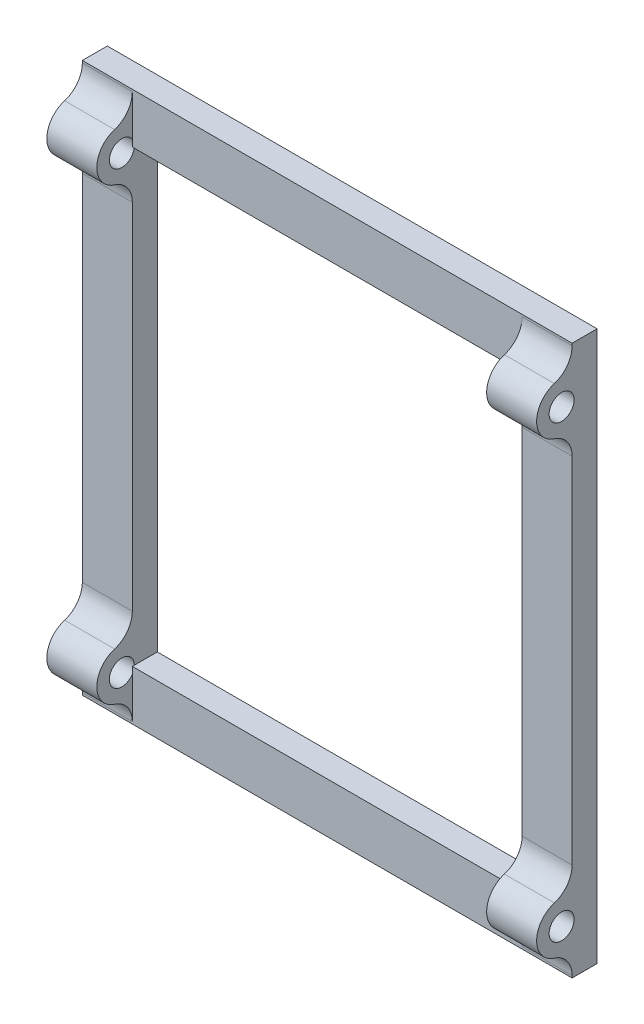
ISO-10303-21;
HEADER;
FILE_DESCRIPTION(('STEP AP214'),'2;1');
FILE_NAME('part.step','',(''),(''),'','','');
FILE_SCHEMA(('AUTOMOTIVE_DESIGN { 1 0 10303 214 1 1 1 1 }'));
ENDSEC;
DATA;
#1=APPLICATION_CONTEXT('core data for automotive mechanical design processes');
#2=APPLICATION_PROTOCOL_DEFINITION('international standard','automotive_design',2000,#1);
#3=PRODUCT_CONTEXT('',#1,'mechanical');
#4=PRODUCT('Part','Part','',(#3));
#5=PRODUCT_RELATED_PRODUCT_CATEGORY('part','',(#4));
#6=PRODUCT_DEFINITION_FORMATION('','',#4);
#7=PRODUCT_DEFINITION_CONTEXT('part definition',#1,'design');
#8=PRODUCT_DEFINITION('design','',#6,#7);
#9=PRODUCT_DEFINITION_SHAPE('','',#8);
#10=(LENGTH_UNIT() NAMED_UNIT(*) SI_UNIT(.MILLI.,.METRE.));
#11=(NAMED_UNIT(*) PLANE_ANGLE_UNIT() SI_UNIT($,.RADIAN.));
#12=(NAMED_UNIT(*) SI_UNIT($,.STERADIAN.) SOLID_ANGLE_UNIT());
#13=UNCERTAINTY_MEASURE_WITH_UNIT(LENGTH_MEASURE(1.E-05),#10,'distance_accuracy_value','');
#14=(GEOMETRIC_REPRESENTATION_CONTEXT(3) GLOBAL_UNCERTAINTY_ASSIGNED_CONTEXT((#13)) GLOBAL_UNIT_ASSIGNED_CONTEXT((#10,
#11,#12)) REPRESENTATION_CONTEXT('',''));
#15=CARTESIAN_POINT('',(0.,0.,0.));
#16=DIRECTION('',(0.,0.,1.));
#17=DIRECTION('',(1.,0.,0.));
#18=AXIS2_PLACEMENT_3D('',#15,#16,#17);
#19=CARTESIAN_POINT('',(0.,0.,5.));
#20=DIRECTION('',(0.,0.,1.));
#21=DIRECTION('',(1.,0.,0.));
#22=AXIS2_PLACEMENT_3D('',#19,#20,#21);
#23=PLANE('',#22);
#24=DIRECTION('',(0.,1.,0.));
#25=VECTOR('',#24,1.);
#26=CARTESIAN_POINT('',(103.666666666667,104.166666666667,5.));
#27=LINE('',#26,#25);
#28=CARTESIAN_POINT('',(103.666666666667,-5.83333333333334,5.));
#29=VERTEX_POINT('',#28);
#30=CARTESIAN_POINT('',(103.666666666667,-5.4035997873042,5.));
#31=VERTEX_POINT('',#30);
#32=EDGE_CURVE('E352',#29,#31,#27,.T.);
#33=ORIENTED_EDGE('',*,*,#32,.T.);
#34=DIRECTION('',(-1.,0.,0.));
#35=VECTOR('',#34,1.);
#36=CARTESIAN_POINT('',(93.6666666666667,-5.40359978730421,5.));
#37=LINE('',#36,#35);
#38=CARTESIAN_POINT('',(93.6666666666667,-5.40359978730421,5.));
#39=VERTEX_POINT('',#38);
#40=EDGE_CURVE('E410',#31,#39,#37,.T.);
#41=ORIENTED_EDGE('',*,*,#40,.T.);
#42=DIRECTION('',(0.,1.,0.));
#43=VECTOR('',#42,1.);
#44=CARTESIAN_POINT('',(93.6666666666667,0.,5.));
#45=LINE('',#44,#43);
#46=CARTESIAN_POINT('',(93.6666666666667,2.8102006700416,5.));
#47=VERTEX_POINT('',#46);
#48=EDGE_CURVE('E285',#39,#47,#45,.T.);
#49=ORIENTED_EDGE('',*,*,#48,.T.);
#50=DIRECTION('',(0.,1.,0.));
#51=VECTOR('',#50,1.);
#52=CARTESIAN_POINT('',(93.6666666666667,0.,5.));
#53=LINE('',#52,#51);
#54=CARTESIAN_POINT('',(93.6666666666667,4.16666666666666,5.));
#55=VERTEX_POINT('',#54);
#56=EDGE_CURVE('E248',#47,#55,#53,.T.);
#57=ORIENTED_EDGE('',*,*,#56,.T.);
#58=DIRECTION('',(1.,0.,0.));
#59=VECTOR('',#58,1.);
#60=CARTESIAN_POINT('',(15.6666666666667,4.16666666666666,5.));
#61=LINE('',#60,#59);
#62=CARTESIAN_POINT('',(15.6666666666667,4.16666666666666,5.));
#63=VERTEX_POINT('',#62);
#64=EDGE_CURVE('E239',#63,#55,#61,.T.);
#65=ORIENTED_EDGE('',*,*,#64,.F.);
#66=DIRECTION('',(0.,1.,0.));
#67=VECTOR('',#66,1.);
#68=CARTESIAN_POINT('',(15.6666666666667,0.,5.));
#69=LINE('',#68,#67);
#70=CARTESIAN_POINT('',(15.6666666666667,2.8102006700416,5.));
#71=VERTEX_POINT('',#70);
#72=EDGE_CURVE('E223',#71,#63,#69,.T.);
#73=ORIENTED_EDGE('',*,*,#72,.F.);
#74=DIRECTION('',(0.,1.,0.));
#75=VECTOR('',#74,1.);
#76=CARTESIAN_POINT('',(15.6666666666667,0.,5.));
#77=LINE('',#76,#75);
#78=CARTESIAN_POINT('',(15.6666666666667,-5.40359978730421,5.));
#79=VERTEX_POINT('',#78);
#80=EDGE_CURVE('E235',#79,#71,#77,.T.);
#81=ORIENTED_EDGE('',*,*,#80,.F.);
#82=DIRECTION('',(-1.,0.,0.));
#83=VECTOR('',#82,1.);
#84=CARTESIAN_POINT('',(5.66666666666668,-5.40359978730421,5.));
#85=LINE('',#84,#83);
#86=CARTESIAN_POINT('',(5.66666666666666,-5.4035997873042,5.));
#87=VERTEX_POINT('',#86);
#88=EDGE_CURVE('E408',#79,#87,#85,.T.);
#89=ORIENTED_EDGE('',*,*,#88,.T.);
#90=DIRECTION('',(0.,-1.,0.));
#91=VECTOR('',#90,1.);
#92=CARTESIAN_POINT('',(5.66666666666665,104.166666666667,5.));
#93=LINE('',#92,#91);
#94=CARTESIAN_POINT('',(5.66666666666666,-5.83333333333334,5.));
#95=VERTEX_POINT('',#94);
#96=EDGE_CURVE('E349',#87,#95,#93,.T.);
#97=ORIENTED_EDGE('',*,*,#96,.T.);
#98=DIRECTION('',(1.,0.,0.));
#99=VECTOR('',#98,1.);
#100=CARTESIAN_POINT('',(5.66666666666666,-5.83333333333334,5.));
#101=LINE('',#100,#99);
#102=EDGE_CURVE('E347',#95,#29,#101,.T.);
#103=ORIENTED_EDGE('',*,*,#102,.T.);
#104=EDGE_LOOP('',(#33,#41,#49,#57,#65,#73,#81,#89,#97,#103));
#105=FACE_BOUND('',#104,.T.);
#106=ADVANCED_FACE('F34',(#105),#23,.T.);
#107=CARTESIAN_POINT('',(5.66666666666665,104.166666666667,5.));
#108=VERTEX_POINT('',#107);
#109=CARTESIAN_POINT('',(5.66666666666665,103.736933120638,5.));
#110=VERTEX_POINT('',#109);
#111=EDGE_CURVE('E344',#108,#110,#93,.T.);
#112=ORIENTED_EDGE('',*,*,#111,.T.);
#113=DIRECTION('',(-1.,0.,0.));
#114=VECTOR('',#113,1.);
#115=CARTESIAN_POINT('',(15.6666666666667,103.736933120638,5.));
#116=LINE('',#115,#114);
#117=CARTESIAN_POINT('',(15.6666666666667,103.736933120638,5.));
#118=VERTEX_POINT('',#117);
#119=EDGE_CURVE('E385',#110,#118,#116,.F.);
#120=ORIENTED_EDGE('',*,*,#119,.T.);
#121=DIRECTION('',(0.,1.,0.));
#122=VECTOR('',#121,1.);
#123=CARTESIAN_POINT('',(15.6666666666667,0.,5.));
#124=LINE('',#123,#122);
#125=CARTESIAN_POINT('',(15.6666666666667,95.5231326632917,5.));
#126=VERTEX_POINT('',#125);
#127=EDGE_CURVE('E271',#126,#118,#124,.T.);
#128=ORIENTED_EDGE('',*,*,#127,.F.);
#129=DIRECTION('',(0.,1.,0.));
#130=VECTOR('',#129,1.);
#131=CARTESIAN_POINT('',(15.6666666666667,0.,5.));
#132=LINE('',#131,#130);
#133=CARTESIAN_POINT('',(15.6666666666667,94.1666666666667,5.));
#134=VERTEX_POINT('',#133);
#135=EDGE_CURVE('E240',#134,#126,#132,.T.);
#136=ORIENTED_EDGE('',*,*,#135,.F.);
#137=DIRECTION('',(-1.,0.,0.));
#138=VECTOR('',#137,1.);
#139=CARTESIAN_POINT('',(15.6666666666667,94.1666666666667,5.));
#140=LINE('',#139,#138);
#141=CARTESIAN_POINT('',(93.6666666666667,94.1666666666667,5.));
#142=VERTEX_POINT('',#141);
#143=EDGE_CURVE('E316',#142,#134,#140,.T.);
#144=ORIENTED_EDGE('',*,*,#143,.F.);
#145=DIRECTION('',(0.,1.,0.));
#146=VECTOR('',#145,1.);
#147=CARTESIAN_POINT('',(93.6666666666667,0.,5.));
#148=LINE('',#147,#146);
#149=CARTESIAN_POINT('',(93.6666666666667,95.5231326632917,5.));
#150=VERTEX_POINT('',#149);
#151=EDGE_CURVE('E292',#142,#150,#148,.T.);
#152=ORIENTED_EDGE('',*,*,#151,.T.);
#153=DIRECTION('',(0.,1.,0.));
#154=VECTOR('',#153,1.);
#155=CARTESIAN_POINT('',(93.6666666666667,0.,5.));
#156=LINE('',#155,#154);
#157=CARTESIAN_POINT('',(93.6666666666667,103.736933120638,5.));
#158=VERTEX_POINT('',#157);
#159=EDGE_CURVE('E304',#150,#158,#156,.T.);
#160=ORIENTED_EDGE('',*,*,#159,.T.);
#161=DIRECTION('',(-1.,0.,0.));
#162=VECTOR('',#161,1.);
#163=CARTESIAN_POINT('',(103.666666666667,103.736933120638,5.));
#164=LINE('',#163,#162);
#165=CARTESIAN_POINT('',(103.666666666667,103.736933120638,5.));
#166=VERTEX_POINT('',#165);
#167=EDGE_CURVE('E383',#158,#166,#164,.F.);
#168=ORIENTED_EDGE('',*,*,#167,.T.);
#169=CARTESIAN_POINT('',(103.666666666667,104.166666666667,5.));
#170=VERTEX_POINT('',#169);
#171=EDGE_CURVE('E351',#166,#170,#27,.T.);
#172=ORIENTED_EDGE('',*,*,#171,.T.);
#173=DIRECTION('',(-1.,0.,0.));
#174=VECTOR('',#173,1.);
#175=CARTESIAN_POINT('',(5.66666666666665,104.166666666667,5.));
#176=LINE('',#175,#174);
#177=EDGE_CURVE('E354',#170,#108,#176,.T.);
#178=ORIENTED_EDGE('',*,*,#177,.T.);
#179=EDGE_LOOP('',(#112,#120,#128,#136,#144,#152,#160,#168,#172,#178));
#180=FACE_BOUND('',#179,.T.);
#181=ADVANCED_FACE('F453',(#180),#23,.T.);
#182=CARTESIAN_POINT('',(5.66666666666665,84.5964002126958,5.));
#183=VERTEX_POINT('',#182);
#184=CARTESIAN_POINT('',(5.66666666666666,13.7369331206375,5.));
#185=VERTEX_POINT('',#184);
#186=EDGE_CURVE('E348',#183,#185,#93,.T.);
#187=ORIENTED_EDGE('',*,*,#186,.T.);
#188=DIRECTION('',(-1.,0.,0.));
#189=VECTOR('',#188,1.);
#190=CARTESIAN_POINT('',(15.6666666666667,13.7369331206375,5.));
#191=LINE('',#190,#189);
#192=CARTESIAN_POINT('',(15.6666666666667,13.7369331206376,5.));
#193=VERTEX_POINT('',#192);
#194=EDGE_CURVE('E396',#185,#193,#191,.F.);
#195=ORIENTED_EDGE('',*,*,#194,.T.);
#196=DIRECTION('',(0.,-1.,0.));
#197=VECTOR('',#196,1.);
#198=CARTESIAN_POINT('',(15.6666666666667,94.1666666666667,5.));
#199=LINE('',#198,#197);
#200=CARTESIAN_POINT('',(15.6666666666667,84.5964002126958,5.));
#201=VERTEX_POINT('',#200);
#202=EDGE_CURVE('E308',#201,#193,#199,.T.);
#203=ORIENTED_EDGE('',*,*,#202,.F.);
#204=DIRECTION('',(-1.,0.,0.));
#205=VECTOR('',#204,1.);
#206=CARTESIAN_POINT('',(5.66666666666666,84.5964002126958,5.));
#207=LINE('',#206,#205);
#208=EDGE_CURVE('E394',#201,#183,#207,.T.);
#209=ORIENTED_EDGE('',*,*,#208,.T.);
#210=EDGE_LOOP('',(#187,#195,#203,#209));
#211=FACE_BOUND('',#210,.T.);
#212=ADVANCED_FACE('F486',(#211),#23,.T.);
#213=DIRECTION('',(0.,1.,0.));
#214=VECTOR('',#213,1.);
#215=CARTESIAN_POINT('',(93.6666666666667,94.1666666666667,5.));
#216=LINE('',#215,#214);
#217=CARTESIAN_POINT('',(93.6666666666667,13.7369331206376,5.));
#218=VERTEX_POINT('',#217);
#219=CARTESIAN_POINT('',(93.6666666666667,84.5964002126958,5.));
#220=VERTEX_POINT('',#219);
#221=EDGE_CURVE('E313',#218,#220,#216,.T.);
#222=ORIENTED_EDGE('',*,*,#221,.F.);
#223=DIRECTION('',(-1.,0.,0.));
#224=VECTOR('',#223,1.);
#225=CARTESIAN_POINT('',(103.666666666667,13.7369331206375,5.));
#226=LINE('',#225,#224);
#227=CARTESIAN_POINT('',(103.666666666667,13.7369331206375,5.));
#228=VERTEX_POINT('',#227);
#229=EDGE_CURVE('E406',#218,#228,#226,.F.);
#230=ORIENTED_EDGE('',*,*,#229,.T.);
#231=CARTESIAN_POINT('',(103.666666666667,84.5964002126958,5.));
#232=VERTEX_POINT('',#231);
#233=EDGE_CURVE('E355',#228,#232,#27,.T.);
#234=ORIENTED_EDGE('',*,*,#233,.T.);
#235=DIRECTION('',(-1.,0.,0.));
#236=VECTOR('',#235,1.);
#237=CARTESIAN_POINT('',(93.6666666666667,84.5964002126958,5.));
#238=LINE('',#237,#236);
#239=EDGE_CURVE('E404',#232,#220,#238,.T.);
#240=ORIENTED_EDGE('',*,*,#239,.T.);
#241=EDGE_LOOP('',(#222,#230,#234,#240));
#242=FACE_BOUND('',#241,.T.);
#243=ADVANCED_FACE('F461',(#242),#23,.T.);
#244=CARTESIAN_POINT('',(0.,0.,0.));
#245=DIRECTION('',(0.,0.,1.));
#246=DIRECTION('',(1.,0.,0.));
#247=AXIS2_PLACEMENT_3D('',#244,#245,#246);
#248=PLANE('',#247);
#249=DIRECTION('',(0.,-1.,0.));
#250=VECTOR('',#249,1.);
#251=CARTESIAN_POINT('',(5.66666666666665,104.166666666667,0.));
#252=LINE('',#251,#250);
#253=CARTESIAN_POINT('',(5.66666666666665,104.166666666667,0.));
#254=VERTEX_POINT('',#253);
#255=CARTESIAN_POINT('',(5.66666666666666,-5.83333333333334,0.));
#256=VERTEX_POINT('',#255);
#257=EDGE_CURVE('E343',#254,#256,#252,.T.);
#258=ORIENTED_EDGE('',*,*,#257,.F.);
#259=DIRECTION('',(-1.,0.,0.));
#260=VECTOR('',#259,1.);
#261=CARTESIAN_POINT('',(5.66666666666665,104.166666666667,0.));
#262=LINE('',#261,#260);
#263=CARTESIAN_POINT('',(103.666666666667,104.166666666667,0.));
#264=VERTEX_POINT('',#263);
#265=EDGE_CURVE('E364',#264,#254,#262,.T.);
#266=ORIENTED_EDGE('',*,*,#265,.F.);
#267=DIRECTION('',(0.,1.,0.));
#268=VECTOR('',#267,1.);
#269=CARTESIAN_POINT('',(103.666666666667,104.166666666667,0.));
#270=LINE('',#269,#268);
#271=CARTESIAN_POINT('',(103.666666666667,-5.83333333333334,0.));
#272=VERTEX_POINT('',#271);
#273=EDGE_CURVE('E362',#272,#264,#270,.T.);
#274=ORIENTED_EDGE('',*,*,#273,.F.);
#275=DIRECTION('',(1.,0.,0.));
#276=VECTOR('',#275,1.);
#277=CARTESIAN_POINT('',(5.66666666666666,-5.83333333333334,0.));
#278=LINE('',#277,#276);
#279=EDGE_CURVE('E360',#256,#272,#278,.T.);
#280=ORIENTED_EDGE('',*,*,#279,.F.);
#281=EDGE_LOOP('',(#258,#266,#274,#280));
#282=FACE_BOUND('',#281,.T.);
#283=DIRECTION('',(0.,-1.,0.));
#284=VECTOR('',#283,1.);
#285=CARTESIAN_POINT('',(15.6666666666667,94.1666666666667,0.));
#286=LINE('',#285,#284);
#287=CARTESIAN_POINT('',(15.6666666666667,94.1666666666667,0.));
#288=VERTEX_POINT('',#287);
#289=CARTESIAN_POINT('',(15.6666666666667,4.16666666666666,0.));
#290=VERTEX_POINT('',#289);
#291=EDGE_CURVE('E307',#288,#290,#286,.T.);
#292=ORIENTED_EDGE('',*,*,#291,.T.);
#293=DIRECTION('',(1.,0.,0.));
#294=VECTOR('',#293,1.);
#295=CARTESIAN_POINT('',(15.6666666666667,4.16666666666666,0.));
#296=LINE('',#295,#294);
#297=CARTESIAN_POINT('',(93.6666666666667,4.16666666666666,0.));
#298=VERTEX_POINT('',#297);
#299=EDGE_CURVE('E322',#290,#298,#296,.T.);
#300=ORIENTED_EDGE('',*,*,#299,.T.);
#301=DIRECTION('',(0.,1.,0.));
#302=VECTOR('',#301,1.);
#303=CARTESIAN_POINT('',(93.6666666666667,94.1666666666667,0.));
#304=LINE('',#303,#302);
#305=CARTESIAN_POINT('',(93.6666666666667,94.1666666666667,0.));
#306=VERTEX_POINT('',#305);
#307=EDGE_CURVE('E325',#298,#306,#304,.T.);
#308=ORIENTED_EDGE('',*,*,#307,.T.);
#309=DIRECTION('',(-1.,0.,0.));
#310=VECTOR('',#309,1.);
#311=CARTESIAN_POINT('',(15.6666666666667,94.1666666666667,0.));
#312=LINE('',#311,#310);
#313=EDGE_CURVE('E311',#306,#288,#312,.T.);
#314=ORIENTED_EDGE('',*,*,#313,.T.);
#315=EDGE_LOOP('',(#292,#300,#308,#314));
#316=FACE_BOUND('',#315,.T.);
#317=ADVANCED_FACE('F490',(#282,#316),#248,.F.);
#318=CARTESIAN_POINT('',(5.66666666666665,104.166666666667,5.));
#319=DIRECTION('',(1.,0.,0.));
#320=DIRECTION('',(0.,1.,0.));
#321=AXIS2_PLACEMENT_3D('',#318,#319,#320);
#322=PLANE('',#321);
#323=ORIENTED_EDGE('',*,*,#96,.F.);
#324=CARTESIAN_POINT('',(5.66666666666666,-5.40359978730421,10.));
#325=DIRECTION('',(1.,0.,0.));
#326=DIRECTION('',(0.,1.,0.));
#327=AXIS2_PLACEMENT_3D('',#324,#325,#326);
#328=CIRCLE('',#327,5.);
#329=CARTESIAN_POINT('',(5.66666666666668,-0.618466560318776,8.55));
#330=VERTEX_POINT('',#329);
#331=EDGE_CURVE('E435',#87,#330,#328,.T.);
#332=ORIENTED_EDGE('',*,*,#331,.T.);
#333=CARTESIAN_POINT('',(5.66666666666668,4.16666666666666,7.1));
#334=DIRECTION('',(1.,0.,0.));
#335=DIRECTION('',(0.,1.,0.));
#336=AXIS2_PLACEMENT_3D('',#333,#334,#335);
#337=CIRCLE('',#336,5.00000000000001);
#338=CARTESIAN_POINT('',(5.66666666666667,8.9517998936521,8.55));
#339=VERTEX_POINT('',#338);
#340=EDGE_CURVE('E256',#339,#330,#337,.T.);
#341=ORIENTED_EDGE('',*,*,#340,.F.);
#342=CARTESIAN_POINT('',(5.66666666666666,13.7369331206375,10.));
#343=DIRECTION('',(1.,0.,0.));
#344=DIRECTION('',(0.,1.,0.));
#345=AXIS2_PLACEMENT_3D('',#342,#343,#344);
#346=CIRCLE('',#345,5.);
#347=EDGE_CURVE('E422',#339,#185,#346,.T.);
#348=ORIENTED_EDGE('',*,*,#347,.T.);
#349=ORIENTED_EDGE('',*,*,#186,.F.);
#350=CARTESIAN_POINT('',(5.66666666666665,84.5964002126958,10.));
#351=DIRECTION('',(1.,0.,0.));
#352=DIRECTION('',(0.,1.,0.));
#353=AXIS2_PLACEMENT_3D('',#350,#351,#352);
#354=CIRCLE('',#353,5.);
#355=CARTESIAN_POINT('',(5.66666666666666,89.3815334396812,8.55));
#356=VERTEX_POINT('',#355);
#357=EDGE_CURVE('E439',#183,#356,#354,.T.);
#358=ORIENTED_EDGE('',*,*,#357,.T.);
#359=CARTESIAN_POINT('',(5.66666666666666,94.1666666666667,7.1));
#360=DIRECTION('',(1.,0.,0.));
#361=DIRECTION('',(0.,1.,0.));
#362=AXIS2_PLACEMENT_3D('',#359,#360,#361);
#363=CIRCLE('',#362,5.00000000000001);
#364=CARTESIAN_POINT('',(5.66666666666666,98.9517998936521,8.55));
#365=VERTEX_POINT('',#364);
#366=EDGE_CURVE('E268',#365,#356,#363,.T.);
#367=ORIENTED_EDGE('',*,*,#366,.F.);
#368=CARTESIAN_POINT('',(5.66666666666665,103.736933120638,10.));
#369=DIRECTION('',(1.,0.,0.));
#370=DIRECTION('',(0.,1.,0.));
#371=AXIS2_PLACEMENT_3D('',#368,#369,#370);
#372=CIRCLE('',#371,5.);
#373=EDGE_CURVE('E418',#365,#110,#372,.T.);
#374=ORIENTED_EDGE('',*,*,#373,.T.);
#375=ORIENTED_EDGE('',*,*,#111,.F.);
#376=DIRECTION('',(0.,0.,-1.));
#377=VECTOR('',#376,1.);
#378=CARTESIAN_POINT('',(5.66666666666665,104.166666666667,5.));
#379=LINE('',#378,#377);
#380=EDGE_CURVE('E357',#108,#254,#379,.T.);
#381=ORIENTED_EDGE('',*,*,#380,.T.);
#382=ORIENTED_EDGE('',*,*,#257,.T.);
#383=DIRECTION('',(0.,0.,-1.));
#384=VECTOR('',#383,1.);
#385=CARTESIAN_POINT('',(5.66666666666666,-5.83333333333334,5.));
#386=LINE('',#385,#384);
#387=EDGE_CURVE('E374',#95,#256,#386,.T.);
#388=ORIENTED_EDGE('',*,*,#387,.F.);
#389=EDGE_LOOP('',(#323,#332,#341,#348,#349,#358,#367,#374,#375,#381,#382,#388));
#390=FACE_BOUND('',#389,.T.);
#391=CARTESIAN_POINT('',(5.66666666666668,4.16666666666666,7.1));
#392=DIRECTION('',(1.,0.,0.));
#393=DIRECTION('',(0.,1.,0.));
#394=AXIS2_PLACEMENT_3D('',#391,#392,#393);
#395=CIRCLE('',#394,2.50000000000001);
#396=CARTESIAN_POINT('',(5.66666666666668,6.66666666666667,7.1));
#397=VERTEX_POINT('',#396);
#398=EDGE_CURVE('E247',#397,#397,#395,.T.);
#399=ORIENTED_EDGE('',*,*,#398,.T.);
#400=EDGE_LOOP('',(#399));
#401=FACE_BOUND('',#400,.T.);
#402=CARTESIAN_POINT('',(5.66666666666666,94.1666666666667,7.1));
#403=DIRECTION('',(1.,0.,0.));
#404=DIRECTION('',(0.,1.,0.));
#405=AXIS2_PLACEMENT_3D('',#402,#403,#404);
#406=CIRCLE('',#405,2.50000000000001);
#407=CARTESIAN_POINT('',(5.66666666666666,96.6666666666667,7.1));
#408=VERTEX_POINT('',#407);
#409=EDGE_CURVE('E258',#408,#408,#406,.T.);
#410=ORIENTED_EDGE('',*,*,#409,.T.);
#411=EDGE_LOOP('',(#410));
#412=FACE_BOUND('',#411,.T.);
#413=ADVANCED_FACE('F495',(#390,#401,#412),#322,.F.);
#414=CARTESIAN_POINT('',(5.66666666666666,-5.83333333333334,5.));
#415=DIRECTION('',(0.,1.,0.));
#416=DIRECTION('',(0.,0.,1.));
#417=AXIS2_PLACEMENT_3D('',#414,#415,#416);
#418=PLANE('',#417);
#419=ORIENTED_EDGE('',*,*,#279,.T.);
#420=DIRECTION('',(0.,0.,-1.));
#421=VECTOR('',#420,1.);
#422=CARTESIAN_POINT('',(103.666666666667,-5.83333333333334,5.));
#423=LINE('',#422,#421);
#424=EDGE_CURVE('E371',#29,#272,#423,.T.);
#425=ORIENTED_EDGE('',*,*,#424,.F.);
#426=ORIENTED_EDGE('',*,*,#102,.F.);
#427=ORIENTED_EDGE('',*,*,#387,.T.);
#428=EDGE_LOOP('',(#419,#425,#426,#427));
#429=FACE_BOUND('',#428,.T.);
#430=ADVANCED_FACE('F558',(#429),#418,.F.);
#431=CARTESIAN_POINT('',(103.666666666667,104.166666666667,5.));
#432=DIRECTION('',(-1.,0.,0.));
#433=DIRECTION('',(0.,-1.,0.));
#434=AXIS2_PLACEMENT_3D('',#431,#432,#433);
#435=PLANE('',#434);
#436=CARTESIAN_POINT('',(103.666666666667,4.16666666666667,7.1));
#437=DIRECTION('',(1.,0.,0.));
#438=DIRECTION('',(0.,1.,0.));
#439=AXIS2_PLACEMENT_3D('',#436,#437,#438);
#440=CIRCLE('',#439,2.50000000000001);
#441=CARTESIAN_POINT('',(103.666666666667,6.66666666666667,7.1));
#442=VERTEX_POINT('',#441);
#443=EDGE_CURVE('E275',#442,#442,#440,.T.);
#444=ORIENTED_EDGE('',*,*,#443,.F.);
#445=EDGE_LOOP('',(#444));
#446=FACE_BOUND('',#445,.T.);
#447=CARTESIAN_POINT('',(103.666666666667,94.1666666666667,7.1));
#448=DIRECTION('',(1.,0.,0.));
#449=DIRECTION('',(0.,1.,0.));
#450=AXIS2_PLACEMENT_3D('',#447,#448,#449);
#451=CIRCLE('',#450,2.50000000000001);
#452=CARTESIAN_POINT('',(103.666666666667,96.6666666666667,7.1));
#453=VERTEX_POINT('',#452);
#454=EDGE_CURVE('E295',#453,#453,#451,.T.);
#455=ORIENTED_EDGE('',*,*,#454,.F.);
#456=EDGE_LOOP('',(#455));
#457=FACE_BOUND('',#456,.T.);
#458=ORIENTED_EDGE('',*,*,#233,.F.);
#459=CARTESIAN_POINT('',(103.666666666667,13.7369331206375,10.));
#460=DIRECTION('',(-1.,0.,0.));
#461=DIRECTION('',(0.,-1.,0.));
#462=AXIS2_PLACEMENT_3D('',#459,#460,#461);
#463=CIRCLE('',#462,5.);
#464=CARTESIAN_POINT('',(103.666666666667,8.9517998936521,8.55));
#465=VERTEX_POINT('',#464);
#466=EDGE_CURVE('E428',#228,#465,#463,.T.);
#467=ORIENTED_EDGE('',*,*,#466,.T.);
#468=CARTESIAN_POINT('',(103.666666666667,4.16666666666667,7.1));
#469=DIRECTION('',(1.,0.,0.));
#470=DIRECTION('',(0.,1.,0.));
#471=AXIS2_PLACEMENT_3D('',#468,#469,#470);
#472=CIRCLE('',#471,5.00000000000001);
#473=CARTESIAN_POINT('',(103.666666666667,-0.618466560318773,8.55));
#474=VERTEX_POINT('',#473);
#475=EDGE_CURVE('E279',#465,#474,#472,.T.);
#476=ORIENTED_EDGE('',*,*,#475,.T.);
#477=CARTESIAN_POINT('',(103.666666666667,-5.40359978730421,10.));
#478=DIRECTION('',(-1.,0.,0.));
#479=DIRECTION('',(0.,-1.,0.));
#480=AXIS2_PLACEMENT_3D('',#477,#478,#479);
#481=CIRCLE('',#480,5.);
#482=EDGE_CURVE('E430',#474,#31,#481,.T.);
#483=ORIENTED_EDGE('',*,*,#482,.T.);
#484=ORIENTED_EDGE('',*,*,#32,.F.);
#485=ORIENTED_EDGE('',*,*,#424,.T.);
#486=ORIENTED_EDGE('',*,*,#273,.T.);
#487=DIRECTION('',(0.,0.,-1.));
#488=VECTOR('',#487,1.);
#489=CARTESIAN_POINT('',(103.666666666667,104.166666666667,5.));
#490=LINE('',#489,#488);
#491=EDGE_CURVE('E368',#170,#264,#490,.T.);
#492=ORIENTED_EDGE('',*,*,#491,.F.);
#493=ORIENTED_EDGE('',*,*,#171,.F.);
#494=CARTESIAN_POINT('',(103.666666666667,103.736933120638,10.));
#495=DIRECTION('',(-1.,0.,0.));
#496=DIRECTION('',(0.,-1.,0.));
#497=AXIS2_PLACEMENT_3D('',#494,#495,#496);
#498=CIRCLE('',#497,5.);
#499=CARTESIAN_POINT('',(103.666666666667,98.9517998936521,8.55));
#500=VERTEX_POINT('',#499);
#501=EDGE_CURVE('E11',#166,#500,#498,.T.);
#502=ORIENTED_EDGE('',*,*,#501,.T.);
#503=CARTESIAN_POINT('',(103.666666666667,94.1666666666667,7.1));
#504=DIRECTION('',(1.,0.,0.));
#505=DIRECTION('',(0.,1.,0.));
#506=AXIS2_PLACEMENT_3D('',#503,#504,#505);
#507=CIRCLE('',#506,5.00000000000001);
#508=CARTESIAN_POINT('',(103.666666666667,89.3815334396812,8.55));
#509=VERTEX_POINT('',#508);
#510=EDGE_CURVE('E298',#500,#509,#507,.T.);
#511=ORIENTED_EDGE('',*,*,#510,.T.);
#512=CARTESIAN_POINT('',(103.666666666667,84.5964002126958,10.));
#513=DIRECTION('',(-1.,0.,0.));
#514=DIRECTION('',(0.,-1.,0.));
#515=AXIS2_PLACEMENT_3D('',#512,#513,#514);
#516=CIRCLE('',#515,5.);
#517=EDGE_CURVE('E49',#509,#232,#516,.T.);
#518=ORIENTED_EDGE('',*,*,#517,.T.);
#519=EDGE_LOOP('',(#458,#467,#476,#483,#484,#485,#486,#492,#493,#502,#511,#518));
#520=FACE_BOUND('',#519,.T.);
#521=ADVANCED_FACE('F456',(#446,#457,#520),#435,.F.);
#522=CARTESIAN_POINT('',(5.66666666666665,104.166666666667,5.));
#523=DIRECTION('',(0.,-1.,0.));
#524=DIRECTION('',(0.,0.,-1.));
#525=AXIS2_PLACEMENT_3D('',#522,#523,#524);
#526=PLANE('',#525);
#527=ORIENTED_EDGE('',*,*,#265,.T.);
#528=ORIENTED_EDGE('',*,*,#380,.F.);
#529=ORIENTED_EDGE('',*,*,#177,.F.);
#530=ORIENTED_EDGE('',*,*,#491,.T.);
#531=EDGE_LOOP('',(#527,#528,#529,#530));
#532=FACE_BOUND('',#531,.T.);
#533=ADVANCED_FACE('F695',(#532),#526,.F.);
#534=CARTESIAN_POINT('',(15.6666666666667,94.1666666666667,5.));
#535=DIRECTION('',(1.,0.,0.));
#536=DIRECTION('',(0.,1.,0.));
#537=AXIS2_PLACEMENT_3D('',#534,#535,#536);
#538=PLANE('',#537);
#539=DIRECTION('',(0.,0.,-1.));
#540=VECTOR('',#539,1.);
#541=CARTESIAN_POINT('',(15.6666666666667,94.1666666666667,5.));
#542=LINE('',#541,#540);
#543=CARTESIAN_POINT('',(15.6666666666667,94.1666666666667,4.59999999999999));
#544=VERTEX_POINT('',#543);
#545=EDGE_CURVE('E319',#544,#288,#542,.T.);
#546=ORIENTED_EDGE('',*,*,#545,.F.);
#547=CARTESIAN_POINT('',(15.6666666666667,94.1666666666667,7.1));
#548=DIRECTION('',(1.,0.,0.));
#549=DIRECTION('',(0.,1.,0.));
#550=AXIS2_PLACEMENT_3D('',#547,#548,#549);
#551=CIRCLE('',#550,2.50000000000001);
#552=EDGE_CURVE('E255',#126,#544,#551,.T.);
#553=ORIENTED_EDGE('',*,*,#552,.F.);
#554=ORIENTED_EDGE('',*,*,#127,.T.);
#555=CARTESIAN_POINT('',(15.6666666666666,103.736933120638,10.));
#556=DIRECTION('',(1.,0.,0.));
#557=DIRECTION('',(0.,1.,0.));
#558=AXIS2_PLACEMENT_3D('',#555,#556,#557);
#559=CIRCLE('',#558,5.);
#560=CARTESIAN_POINT('',(15.6666666666667,98.9517998936521,8.55));
#561=VERTEX_POINT('',#560);
#562=EDGE_CURVE('E420',#118,#561,#559,.F.);
#563=ORIENTED_EDGE('',*,*,#562,.T.);
#564=CARTESIAN_POINT('',(15.6666666666667,94.1666666666667,7.1));
#565=DIRECTION('',(1.,0.,0.));
#566=DIRECTION('',(0.,1.,0.));
#567=AXIS2_PLACEMENT_3D('',#564,#565,#566);
#568=CIRCLE('',#567,5.00000000000001);
#569=CARTESIAN_POINT('',(15.6666666666667,89.3815334396812,8.55));
#570=VERTEX_POINT('',#569);
#571=EDGE_CURVE('E266',#561,#570,#568,.T.);
#572=ORIENTED_EDGE('',*,*,#571,.T.);
#573=CARTESIAN_POINT('',(15.6666666666667,84.5964002126958,10.));
#574=DIRECTION('',(1.,0.,0.));
#575=DIRECTION('',(0.,1.,0.));
#576=AXIS2_PLACEMENT_3D('',#573,#574,#575);
#577=CIRCLE('',#576,5.);
#578=EDGE_CURVE('E437',#570,#201,#577,.F.);
#579=ORIENTED_EDGE('',*,*,#578,.T.);
#580=ORIENTED_EDGE('',*,*,#202,.T.);
#581=CARTESIAN_POINT('',(15.6666666666667,13.7369331206375,10.));
#582=DIRECTION('',(1.,0.,0.));
#583=DIRECTION('',(0.,1.,0.));
#584=AXIS2_PLACEMENT_3D('',#581,#582,#583);
#585=CIRCLE('',#584,5.);
#586=CARTESIAN_POINT('',(15.6666666666667,8.9517998936521,8.55));
#587=VERTEX_POINT('',#586);
#588=EDGE_CURVE('E424',#193,#587,#585,.F.);
#589=ORIENTED_EDGE('',*,*,#588,.T.);
#590=CARTESIAN_POINT('',(15.6666666666667,4.16666666666667,7.1));
#591=DIRECTION('',(1.,0.,0.));
#592=DIRECTION('',(0.,1.,0.));
#593=AXIS2_PLACEMENT_3D('',#590,#591,#592);
#594=CIRCLE('',#593,5.00000000000001);
#595=CARTESIAN_POINT('',(15.6666666666667,-0.618466560318773,8.55));
#596=VERTEX_POINT('',#595);
#597=EDGE_CURVE('E261',#587,#596,#594,.T.);
#598=ORIENTED_EDGE('',*,*,#597,.T.);
#599=CARTESIAN_POINT('',(15.6666666666667,-5.40359978730421,10.));
#600=DIRECTION('',(1.,0.,0.));
#601=DIRECTION('',(0.,1.,0.));
#602=AXIS2_PLACEMENT_3D('',#599,#600,#601);
#603=CIRCLE('',#602,5.);
#604=EDGE_CURVE('E253',#596,#79,#603,.F.);
#605=ORIENTED_EDGE('',*,*,#604,.T.);
#606=ORIENTED_EDGE('',*,*,#80,.T.);
#607=CARTESIAN_POINT('',(15.6666666666667,4.16666666666667,7.1));
#608=DIRECTION('',(1.,0.,0.));
#609=DIRECTION('',(0.,1.,0.));
#610=AXIS2_PLACEMENT_3D('',#607,#608,#609);
#611=CIRCLE('',#610,2.50000000000001);
#612=CARTESIAN_POINT('',(15.6666666666667,4.16666666666666,4.59999999999999));
#613=VERTEX_POINT('',#612);
#614=EDGE_CURVE('E243',#613,#71,#611,.T.);
#615=ORIENTED_EDGE('',*,*,#614,.F.);
#616=DIRECTION('',(0.,0.,-1.));
#617=VECTOR('',#616,1.);
#618=CARTESIAN_POINT('',(15.6666666666667,4.16666666666666,5.));
#619=LINE('',#618,#617);
#620=EDGE_CURVE('E341',#613,#290,#619,.T.);
#621=ORIENTED_EDGE('',*,*,#620,.T.);
#622=ORIENTED_EDGE('',*,*,#291,.F.);
#623=EDGE_LOOP('',(#546,#553,#554,#563,#572,#579,#580,#589,#598,#605,#606,#615,#621,#622));
#624=FACE_BOUND('',#623,.T.);
#625=ADVANCED_FACE('F251',(#624),#538,.T.);
#626=CARTESIAN_POINT('',(15.6666666666667,4.16666666666666,5.));
#627=DIRECTION('',(0.,1.,0.));
#628=DIRECTION('',(0.,0.,1.));
#629=AXIS2_PLACEMENT_3D('',#626,#627,#628);
#630=PLANE('',#629);
#631=ORIENTED_EDGE('',*,*,#299,.F.);
#632=ORIENTED_EDGE('',*,*,#620,.F.);
#633=EDGE_CURVE('E225',#63,#613,#619,.T.);
#634=ORIENTED_EDGE('',*,*,#633,.F.);
#635=ORIENTED_EDGE('',*,*,#64,.T.);
#636=DIRECTION('',(0.,0.,-1.));
#637=VECTOR('',#636,1.);
#638=CARTESIAN_POINT('',(93.6666666666667,4.16666666666666,5.));
#639=LINE('',#638,#637);
#640=CARTESIAN_POINT('',(93.6666666666667,4.16666666666666,4.59999999999999));
#641=VERTEX_POINT('',#640);
#642=EDGE_CURVE('E338',#55,#641,#639,.T.);
#643=ORIENTED_EDGE('',*,*,#642,.T.);
#644=EDGE_CURVE('E337',#641,#298,#639,.T.);
#645=ORIENTED_EDGE('',*,*,#644,.T.);
#646=EDGE_LOOP('',(#631,#632,#634,#635,#643,#645));
#647=FACE_BOUND('',#646,.T.);
#648=ADVANCED_FACE('F533',(#647),#630,.T.);
#649=CARTESIAN_POINT('',(93.6666666666667,94.1666666666667,5.));
#650=DIRECTION('',(-1.,0.,0.));
#651=DIRECTION('',(0.,-1.,0.));
#652=AXIS2_PLACEMENT_3D('',#649,#650,#651);
#653=PLANE('',#652);
#654=ORIENTED_EDGE('',*,*,#644,.F.);
#655=CARTESIAN_POINT('',(93.6666666666667,4.16666666666666,7.1));
#656=DIRECTION('',(1.,0.,0.));
#657=DIRECTION('',(0.,1.,0.));
#658=AXIS2_PLACEMENT_3D('',#655,#656,#657);
#659=CIRCLE('',#658,2.50000000000001);
#660=EDGE_CURVE('E276',#641,#47,#659,.T.);
#661=ORIENTED_EDGE('',*,*,#660,.T.);
#662=ORIENTED_EDGE('',*,*,#48,.F.);
#663=CARTESIAN_POINT('',(93.6666666666667,-5.40359978730421,10.));
#664=DIRECTION('',(-1.,0.,0.));
#665=DIRECTION('',(0.,-1.,0.));
#666=AXIS2_PLACEMENT_3D('',#663,#664,#665);
#667=CIRCLE('',#666,5.);
#668=CARTESIAN_POINT('',(93.6666666666667,-0.618466560318776,8.55));
#669=VERTEX_POINT('',#668);
#670=EDGE_CURVE('E432',#39,#669,#667,.F.);
#671=ORIENTED_EDGE('',*,*,#670,.T.);
#672=CARTESIAN_POINT('',(93.6666666666667,4.16666666666666,7.1));
#673=DIRECTION('',(1.,0.,0.));
#674=DIRECTION('',(0.,1.,0.));
#675=AXIS2_PLACEMENT_3D('',#672,#673,#674);
#676=CIRCLE('',#675,5.00000000000001);
#677=CARTESIAN_POINT('',(93.6666666666667,8.9517998936521,8.55));
#678=VERTEX_POINT('',#677);
#679=EDGE_CURVE('E282',#678,#669,#676,.T.);
#680=ORIENTED_EDGE('',*,*,#679,.F.);
#681=CARTESIAN_POINT('',(93.6666666666667,13.7369331206375,10.));
#682=DIRECTION('',(-1.,0.,0.));
#683=DIRECTION('',(0.,-1.,0.));
#684=AXIS2_PLACEMENT_3D('',#681,#682,#683);
#685=CIRCLE('',#684,5.);
#686=EDGE_CURVE('E426',#678,#218,#685,.F.);
#687=ORIENTED_EDGE('',*,*,#686,.T.);
#688=ORIENTED_EDGE('',*,*,#221,.T.);
#689=CARTESIAN_POINT('',(93.6666666666667,84.5964002126958,10.));
#690=DIRECTION('',(-1.,0.,0.));
#691=DIRECTION('',(0.,-1.,0.));
#692=AXIS2_PLACEMENT_3D('',#689,#690,#691);
#693=CIRCLE('',#692,5.);
#694=CARTESIAN_POINT('',(93.6666666666667,89.3815334396812,8.55));
#695=VERTEX_POINT('',#694);
#696=EDGE_CURVE('E442',#220,#695,#693,.F.);
#697=ORIENTED_EDGE('',*,*,#696,.T.);
#698=CARTESIAN_POINT('',(93.6666666666667,94.1666666666667,7.1));
#699=DIRECTION('',(1.,0.,0.));
#700=DIRECTION('',(0.,1.,0.));
#701=AXIS2_PLACEMENT_3D('',#698,#699,#700);
#702=CIRCLE('',#701,5.00000000000001);
#703=CARTESIAN_POINT('',(93.6666666666667,98.9517998936521,8.55));
#704=VERTEX_POINT('',#703);
#705=EDGE_CURVE('E301',#704,#695,#702,.T.);
#706=ORIENTED_EDGE('',*,*,#705,.F.);
#707=CARTESIAN_POINT('',(93.6666666666667,103.736933120638,10.));
#708=DIRECTION('',(-1.,0.,0.));
#709=DIRECTION('',(0.,-1.,0.));
#710=AXIS2_PLACEMENT_3D('',#707,#708,#709);
#711=CIRCLE('',#710,5.);
#712=EDGE_CURVE('E42',#704,#158,#711,.F.);
#713=ORIENTED_EDGE('',*,*,#712,.T.);
#714=ORIENTED_EDGE('',*,*,#159,.F.);
#715=CARTESIAN_POINT('',(93.6666666666667,94.1666666666667,7.1));
#716=DIRECTION('',(1.,0.,0.));
#717=DIRECTION('',(0.,1.,0.));
#718=AXIS2_PLACEMENT_3D('',#715,#716,#717);
#719=CIRCLE('',#718,2.50000000000001);
#720=CARTESIAN_POINT('',(93.6666666666667,94.1666666666667,4.59999999999999));
#721=VERTEX_POINT('',#720);
#722=EDGE_CURVE('E296',#150,#721,#719,.T.);
#723=ORIENTED_EDGE('',*,*,#722,.T.);
#724=DIRECTION('',(0.,0.,-1.));
#725=VECTOR('',#724,1.);
#726=CARTESIAN_POINT('',(93.6666666666667,94.1666666666667,5.));
#727=LINE('',#726,#725);
#728=EDGE_CURVE('E333',#721,#306,#727,.T.);
#729=ORIENTED_EDGE('',*,*,#728,.T.);
#730=ORIENTED_EDGE('',*,*,#307,.F.);
#731=EDGE_LOOP('',(#654,#661,#662,#671,#680,#687,#688,#697,#706,#713,#714,#723,#729,#730));
#732=FACE_BOUND('',#731,.T.);
#733=ADVANCED_FACE('F449',(#732),#653,.T.);
#734=CARTESIAN_POINT('',(15.6666666666667,94.1666666666667,5.));
#735=DIRECTION('',(0.,-1.,0.));
#736=DIRECTION('',(0.,0.,-1.));
#737=AXIS2_PLACEMENT_3D('',#734,#735,#736);
#738=PLANE('',#737);
#739=ORIENTED_EDGE('',*,*,#313,.F.);
#740=ORIENTED_EDGE('',*,*,#728,.F.);
#741=EDGE_CURVE('E334',#142,#721,#727,.T.);
#742=ORIENTED_EDGE('',*,*,#741,.F.);
#743=ORIENTED_EDGE('',*,*,#143,.T.);
#744=EDGE_CURVE('E330',#134,#544,#542,.T.);
#745=ORIENTED_EDGE('',*,*,#744,.T.);
#746=ORIENTED_EDGE('',*,*,#545,.T.);
#747=EDGE_LOOP('',(#739,#740,#742,#743,#745,#746));
#748=FACE_BOUND('',#747,.T.);
#749=ADVANCED_FACE('F470',(#748),#738,.T.);
#750=CARTESIAN_POINT('',(93.6666666666667,94.1666666666667,7.1));
#751=DIRECTION('',(1.,0.,0.));
#752=DIRECTION('',(0.,1.,0.));
#753=AXIS2_PLACEMENT_3D('',#750,#751,#752);
#754=CYLINDRICAL_SURFACE('',#753,5.00000000000001);
#755=ORIENTED_EDGE('',*,*,#705,.T.);
#756=DIRECTION('',(1.,0.,0.));
#757=VECTOR('',#756,1.);
#758=CARTESIAN_POINT('',(93.6666666666667,89.3815334396812,8.55));
#759=LINE('',#758,#757);
#760=EDGE_CURVE('E416',#695,#509,#759,.T.);
#761=ORIENTED_EDGE('',*,*,#760,.T.);
#762=ORIENTED_EDGE('',*,*,#510,.F.);
#763=DIRECTION('',(1.,0.,0.));
#764=VECTOR('',#763,1.);
#765=CARTESIAN_POINT('',(93.6666666666667,98.9517998936521,8.55));
#766=LINE('',#765,#764);
#767=EDGE_CURVE('E413',#500,#704,#766,.F.);
#768=ORIENTED_EDGE('',*,*,#767,.T.);
#769=EDGE_LOOP('',(#755,#761,#762,#768));
#770=FACE_BOUND('',#769,.T.);
#771=ADVANCED_FACE('F467',(#770),#754,.T.);
#772=CARTESIAN_POINT('',(93.6666666666667,94.1666666666667,7.1));
#773=DIRECTION('',(1.,0.,0.));
#774=DIRECTION('',(0.,1.,0.));
#775=AXIS2_PLACEMENT_3D('',#772,#773,#774);
#776=CYLINDRICAL_SURFACE('',#775,2.50000000000001);
#777=ORIENTED_EDGE('',*,*,#454,.T.);
#778=EDGE_LOOP('',(#777));
#779=FACE_BOUND('',#778,.T.);
#780=CARTESIAN_POINT('',(93.6666666666667,94.1666666666667,7.1));
#781=DIRECTION('',(1.,0.,0.));
#782=DIRECTION('',(0.,1.,0.));
#783=AXIS2_PLACEMENT_3D('',#780,#781,#782);
#784=CIRCLE('',#783,2.50000000000001);
#785=EDGE_CURVE('E290',#721,#150,#784,.T.);
#786=ORIENTED_EDGE('',*,*,#785,.F.);
#787=ORIENTED_EDGE('',*,*,#722,.F.);
#788=EDGE_LOOP('',(#786,#787));
#789=FACE_BOUND('',#788,.T.);
#790=ADVANCED_FACE('F469',(#779,#789),#776,.F.);
#791=CARTESIAN_POINT('',(93.6666666666667,94.1666666666667,7.1));
#792=DIRECTION('',(1.,0.,0.));
#793=DIRECTION('',(0.,1.,0.));
#794=AXIS2_PLACEMENT_3D('',#791,#792,#793);
#795=PLANE('',#794);
#796=ORIENTED_EDGE('',*,*,#741,.T.);
#797=ORIENTED_EDGE('',*,*,#785,.T.);
#798=ORIENTED_EDGE('',*,*,#151,.F.);
#799=EDGE_LOOP('',(#796,#797,#798));
#800=FACE_BOUND('',#799,.T.);
#801=ADVANCED_FACE('F476',(#800),#795,.T.);
#802=CARTESIAN_POINT('',(93.6666666666667,4.16666666666666,7.1));
#803=DIRECTION('',(1.,0.,0.));
#804=DIRECTION('',(0.,1.,0.));
#805=AXIS2_PLACEMENT_3D('',#802,#803,#804);
#806=CYLINDRICAL_SURFACE('',#805,5.00000000000001);
#807=ORIENTED_EDGE('',*,*,#475,.F.);
#808=DIRECTION('',(1.,0.,0.));
#809=VECTOR('',#808,1.);
#810=CARTESIAN_POINT('',(93.6666666666667,8.9517998936521,8.55));
#811=LINE('',#810,#809);
#812=EDGE_CURVE('E401',#465,#678,#811,.F.);
#813=ORIENTED_EDGE('',*,*,#812,.T.);
#814=ORIENTED_EDGE('',*,*,#679,.T.);
#815=DIRECTION('',(1.,0.,0.));
#816=VECTOR('',#815,1.);
#817=CARTESIAN_POINT('',(93.6666666666667,-0.618466560318776,8.55));
#818=LINE('',#817,#816);
#819=EDGE_CURVE('E398',#669,#474,#818,.T.);
#820=ORIENTED_EDGE('',*,*,#819,.T.);
#821=EDGE_LOOP('',(#807,#813,#814,#820));
#822=FACE_BOUND('',#821,.T.);
#823=ADVANCED_FACE('F665',(#822),#806,.T.);
#824=CARTESIAN_POINT('',(93.6666666666667,4.16666666666666,7.1));
#825=DIRECTION('',(1.,0.,0.));
#826=DIRECTION('',(0.,1.,0.));
#827=AXIS2_PLACEMENT_3D('',#824,#825,#826);
#828=CYLINDRICAL_SURFACE('',#827,2.50000000000001);
#829=ORIENTED_EDGE('',*,*,#443,.T.);
#830=EDGE_LOOP('',(#829));
#831=FACE_BOUND('',#830,.T.);
#832=CARTESIAN_POINT('',(93.6666666666667,4.16666666666666,7.1));
#833=DIRECTION('',(1.,0.,0.));
#834=DIRECTION('',(0.,1.,0.));
#835=AXIS2_PLACEMENT_3D('',#832,#833,#834);
#836=CIRCLE('',#835,2.50000000000001);
#837=EDGE_CURVE('E241',#47,#641,#836,.T.);
#838=ORIENTED_EDGE('',*,*,#837,.F.);
#839=ORIENTED_EDGE('',*,*,#660,.F.);
#840=EDGE_LOOP('',(#838,#839));
#841=FACE_BOUND('',#840,.T.);
#842=ADVANCED_FACE('F657',(#831,#841),#828,.F.);
#843=CARTESIAN_POINT('',(5.66666666666666,94.1666666666667,7.1));
#844=DIRECTION('',(1.,0.,0.));
#845=DIRECTION('',(0.,1.,0.));
#846=AXIS2_PLACEMENT_3D('',#843,#844,#845);
#847=CYLINDRICAL_SURFACE('',#846,5.00000000000001);
#848=ORIENTED_EDGE('',*,*,#571,.F.);
#849=DIRECTION('',(1.,0.,0.));
#850=VECTOR('',#849,1.);
#851=CARTESIAN_POINT('',(5.66666666666666,98.9517998936521,8.55));
#852=LINE('',#851,#850);
#853=EDGE_CURVE('E380',#561,#365,#852,.F.);
#854=ORIENTED_EDGE('',*,*,#853,.T.);
#855=ORIENTED_EDGE('',*,*,#366,.T.);
#856=DIRECTION('',(1.,0.,0.));
#857=VECTOR('',#856,1.);
#858=CARTESIAN_POINT('',(5.66666666666666,89.3815334396812,8.55));
#859=LINE('',#858,#857);
#860=EDGE_CURVE('E377',#356,#570,#859,.T.);
#861=ORIENTED_EDGE('',*,*,#860,.T.);
#862=EDGE_LOOP('',(#848,#854,#855,#861));
#863=FACE_BOUND('',#862,.T.);
#864=ADVANCED_FACE('F553',(#863),#847,.T.);
#865=CARTESIAN_POINT('',(5.66666666666666,94.1666666666667,7.1));
#866=DIRECTION('',(1.,0.,0.));
#867=DIRECTION('',(0.,1.,0.));
#868=AXIS2_PLACEMENT_3D('',#865,#866,#867);
#869=CYLINDRICAL_SURFACE('',#868,2.50000000000001);
#870=ORIENTED_EDGE('',*,*,#552,.T.);
#871=CARTESIAN_POINT('',(15.6666666666667,94.1666666666667,7.1));
#872=DIRECTION('',(1.,0.,0.));
#873=DIRECTION('',(0.,1.,0.));
#874=AXIS2_PLACEMENT_3D('',#871,#872,#873);
#875=CIRCLE('',#874,2.50000000000001);
#876=EDGE_CURVE('E229',#544,#126,#875,.T.);
#877=ORIENTED_EDGE('',*,*,#876,.T.);
#878=EDGE_LOOP('',(#870,#877));
#879=FACE_BOUND('',#878,.T.);
#880=ORIENTED_EDGE('',*,*,#409,.F.);
#881=EDGE_LOOP('',(#880));
#882=FACE_BOUND('',#881,.T.);
#883=ADVANCED_FACE('F550',(#879,#882),#869,.F.);
#884=CARTESIAN_POINT('',(5.66666666666668,4.16666666666666,7.1));
#885=DIRECTION('',(1.,0.,0.));
#886=DIRECTION('',(0.,1.,0.));
#887=AXIS2_PLACEMENT_3D('',#884,#885,#886);
#888=CYLINDRICAL_SURFACE('',#887,5.00000000000001);
#889=ORIENTED_EDGE('',*,*,#597,.F.);
#890=DIRECTION('',(1.,0.,0.));
#891=VECTOR('',#890,1.);
#892=CARTESIAN_POINT('',(5.66666666666667,8.9517998936521,8.55));
#893=LINE('',#892,#891);
#894=EDGE_CURVE('E391',#587,#339,#893,.F.);
#895=ORIENTED_EDGE('',*,*,#894,.T.);
#896=ORIENTED_EDGE('',*,*,#340,.T.);
#897=DIRECTION('',(1.,0.,0.));
#898=VECTOR('',#897,1.);
#899=CARTESIAN_POINT('',(5.66666666666668,-0.618466560318776,8.55));
#900=LINE('',#899,#898);
#901=EDGE_CURVE('E388',#330,#596,#900,.T.);
#902=ORIENTED_EDGE('',*,*,#901,.T.);
#903=EDGE_LOOP('',(#889,#895,#896,#902));
#904=FACE_BOUND('',#903,.T.);
#905=ADVANCED_FACE('F513',(#904),#888,.T.);
#906=CARTESIAN_POINT('',(5.66666666666668,4.16666666666666,7.1));
#907=DIRECTION('',(1.,0.,0.));
#908=DIRECTION('',(0.,1.,0.));
#909=AXIS2_PLACEMENT_3D('',#906,#907,#908);
#910=CYLINDRICAL_SURFACE('',#909,2.50000000000001);
#911=ORIENTED_EDGE('',*,*,#614,.T.);
#912=CARTESIAN_POINT('',(15.6666666666667,4.16666666666667,7.1));
#913=DIRECTION('',(1.,0.,0.));
#914=DIRECTION('',(0.,1.,0.));
#915=AXIS2_PLACEMENT_3D('',#912,#913,#914);
#916=CIRCLE('',#915,2.50000000000001);
#917=EDGE_CURVE('E220',#71,#613,#916,.T.);
#918=ORIENTED_EDGE('',*,*,#917,.T.);
#919=EDGE_LOOP('',(#911,#918));
#920=FACE_BOUND('',#919,.T.);
#921=ORIENTED_EDGE('',*,*,#398,.F.);
#922=EDGE_LOOP('',(#921));
#923=FACE_BOUND('',#922,.T.);
#924=ADVANCED_FACE('F244',(#920,#923),#910,.F.);
#925=CARTESIAN_POINT('',(15.6666666666667,94.1666666666667,7.1));
#926=DIRECTION('',(1.,0.,0.));
#927=DIRECTION('',(0.,1.,0.));
#928=AXIS2_PLACEMENT_3D('',#925,#926,#927);
#929=PLANE('',#928);
#930=ORIENTED_EDGE('',*,*,#135,.T.);
#931=ORIENTED_EDGE('',*,*,#876,.F.);
#932=ORIENTED_EDGE('',*,*,#744,.F.);
#933=EDGE_LOOP('',(#930,#931,#932));
#934=FACE_BOUND('',#933,.T.);
#935=ADVANCED_FACE('F544',(#934),#929,.F.);
#936=CARTESIAN_POINT('',(93.6666666666667,4.16666666666666,7.1));
#937=DIRECTION('',(1.,0.,0.));
#938=DIRECTION('',(0.,1.,0.));
#939=AXIS2_PLACEMENT_3D('',#936,#937,#938);
#940=PLANE('',#939);
#941=ORIENTED_EDGE('',*,*,#837,.T.);
#942=ORIENTED_EDGE('',*,*,#642,.F.);
#943=ORIENTED_EDGE('',*,*,#56,.F.);
#944=EDGE_LOOP('',(#941,#942,#943));
#945=FACE_BOUND('',#944,.T.);
#946=ADVANCED_FACE('F528',(#945),#940,.T.);
#947=CARTESIAN_POINT('',(15.6666666666667,4.16666666666667,7.1));
#948=DIRECTION('',(1.,0.,0.));
#949=DIRECTION('',(0.,1.,0.));
#950=AXIS2_PLACEMENT_3D('',#947,#948,#949);
#951=PLANE('',#950);
#952=ORIENTED_EDGE('',*,*,#72,.T.);
#953=ORIENTED_EDGE('',*,*,#633,.T.);
#954=ORIENTED_EDGE('',*,*,#917,.F.);
#955=EDGE_LOOP('',(#952,#953,#954));
#956=FACE_BOUND('',#955,.T.);
#957=ADVANCED_FACE('F222',(#956),#951,.F.);
#958=CARTESIAN_POINT('',(5.66666666666666,103.736933120638,10.));
#959=DIRECTION('',(1.,0.,0.));
#960=DIRECTION('',(0.,1.,0.));
#961=AXIS2_PLACEMENT_3D('',#958,#959,#960);
#962=CYLINDRICAL_SURFACE('',#961,5.);
#963=ORIENTED_EDGE('',*,*,#562,.F.);
#964=ORIENTED_EDGE('',*,*,#119,.F.);
#965=ORIENTED_EDGE('',*,*,#373,.F.);
#966=ORIENTED_EDGE('',*,*,#853,.F.);
#967=EDGE_LOOP('',(#963,#964,#965,#966));
#968=FACE_BOUND('',#967,.T.);
#969=ADVANCED_FACE('F568',(#968),#962,.F.);
#970=CARTESIAN_POINT('',(5.66666666666667,13.7369331206375,10.));
#971=DIRECTION('',(1.,0.,0.));
#972=DIRECTION('',(0.,1.,0.));
#973=AXIS2_PLACEMENT_3D('',#970,#971,#972);
#974=CYLINDRICAL_SURFACE('',#973,5.);
#975=ORIENTED_EDGE('',*,*,#588,.F.);
#976=ORIENTED_EDGE('',*,*,#194,.F.);
#977=ORIENTED_EDGE('',*,*,#347,.F.);
#978=ORIENTED_EDGE('',*,*,#894,.F.);
#979=EDGE_LOOP('',(#975,#976,#977,#978));
#980=FACE_BOUND('',#979,.T.);
#981=ADVANCED_FACE('F509',(#980),#974,.F.);
#982=CARTESIAN_POINT('',(93.6666666666667,13.7369331206375,10.));
#983=DIRECTION('',(1.,0.,0.));
#984=DIRECTION('',(0.,1.,0.));
#985=AXIS2_PLACEMENT_3D('',#982,#983,#984);
#986=CYLINDRICAL_SURFACE('',#985,5.);
#987=ORIENTED_EDGE('',*,*,#466,.F.);
#988=ORIENTED_EDGE('',*,*,#229,.F.);
#989=ORIENTED_EDGE('',*,*,#686,.F.);
#990=ORIENTED_EDGE('',*,*,#812,.F.);
#991=EDGE_LOOP('',(#987,#988,#989,#990));
#992=FACE_BOUND('',#991,.T.);
#993=ADVANCED_FACE('F574',(#992),#986,.F.);
#994=CARTESIAN_POINT('',(93.6666666666667,-5.40359978730421,10.));
#995=DIRECTION('',(1.,0.,0.));
#996=DIRECTION('',(0.,1.,0.));
#997=AXIS2_PLACEMENT_3D('',#994,#995,#996);
#998=CYLINDRICAL_SURFACE('',#997,5.);
#999=ORIENTED_EDGE('',*,*,#670,.F.);
#1000=ORIENTED_EDGE('',*,*,#40,.F.);
#1001=ORIENTED_EDGE('',*,*,#482,.F.);
#1002=ORIENTED_EDGE('',*,*,#819,.F.);
#1003=EDGE_LOOP('',(#999,#1000,#1001,#1002));
#1004=FACE_BOUND('',#1003,.T.);
#1005=ADVANCED_FACE('F577',(#1004),#998,.F.);
#1006=CARTESIAN_POINT('',(5.66666666666668,-5.40359978730421,10.));
#1007=DIRECTION('',(1.,0.,0.));
#1008=DIRECTION('',(0.,1.,0.));
#1009=AXIS2_PLACEMENT_3D('',#1006,#1007,#1008);
#1010=CYLINDRICAL_SURFACE('',#1009,5.);
#1011=ORIENTED_EDGE('',*,*,#331,.F.);
#1012=ORIENTED_EDGE('',*,*,#88,.F.);
#1013=ORIENTED_EDGE('',*,*,#604,.F.);
#1014=ORIENTED_EDGE('',*,*,#901,.F.);
#1015=EDGE_LOOP('',(#1011,#1012,#1013,#1014));
#1016=FACE_BOUND('',#1015,.T.);
#1017=ADVANCED_FACE('F581',(#1016),#1010,.F.);
#1018=CARTESIAN_POINT('',(5.66666666666666,84.5964002126958,10.));
#1019=DIRECTION('',(1.,0.,0.));
#1020=DIRECTION('',(0.,1.,0.));
#1021=AXIS2_PLACEMENT_3D('',#1018,#1019,#1020);
#1022=CYLINDRICAL_SURFACE('',#1021,5.);
#1023=ORIENTED_EDGE('',*,*,#357,.F.);
#1024=ORIENTED_EDGE('',*,*,#208,.F.);
#1025=ORIENTED_EDGE('',*,*,#578,.F.);
#1026=ORIENTED_EDGE('',*,*,#860,.F.);
#1027=EDGE_LOOP('',(#1023,#1024,#1025,#1026));
#1028=FACE_BOUND('',#1027,.T.);
#1029=ADVANCED_FACE('F585',(#1028),#1022,.F.);
#1030=CARTESIAN_POINT('',(93.6666666666667,84.5964002126958,10.));
#1031=DIRECTION('',(1.,0.,0.));
#1032=DIRECTION('',(0.,1.,0.));
#1033=AXIS2_PLACEMENT_3D('',#1030,#1031,#1032);
#1034=CYLINDRICAL_SURFACE('',#1033,5.);
#1035=ORIENTED_EDGE('',*,*,#696,.F.);
#1036=ORIENTED_EDGE('',*,*,#239,.F.);
#1037=ORIENTED_EDGE('',*,*,#517,.F.);
#1038=ORIENTED_EDGE('',*,*,#760,.F.);
#1039=EDGE_LOOP('',(#1035,#1036,#1037,#1038));
#1040=FACE_BOUND('',#1039,.T.);
#1041=ADVANCED_FACE('F465',(#1040),#1034,.F.);
#1042=CARTESIAN_POINT('',(93.6666666666667,103.736933120638,10.));
#1043=DIRECTION('',(1.,0.,0.));
#1044=DIRECTION('',(0.,1.,0.));
#1045=AXIS2_PLACEMENT_3D('',#1042,#1043,#1044);
#1046=CYLINDRICAL_SURFACE('',#1045,5.);
#1047=ORIENTED_EDGE('',*,*,#501,.F.);
#1048=ORIENTED_EDGE('',*,*,#167,.F.);
#1049=ORIENTED_EDGE('',*,*,#712,.F.);
#1050=ORIENTED_EDGE('',*,*,#767,.F.);
#1051=EDGE_LOOP('',(#1047,#1048,#1049,#1050));
#1052=FACE_BOUND('',#1051,.T.);
#1053=ADVANCED_FACE('F36',(#1052),#1046,.F.);
#1054=CLOSED_SHELL('',(#106,#181,#212,#243,#317,#413,#430,#521,#533,#625,#648,#733,#749,#771,
#790,#801,#823,#842,#864,#883,#905,#924,#935,#946,#957,#969,#981,#993,#1005,#1017,#1029,#1041,#1053));
#1055=MANIFOLD_SOLID_BREP('B2',#1054);
#1056=ADVANCED_BREP_SHAPE_REPRESENTATION('',(#18,#1055),#14);
#1057=SHAPE_DEFINITION_REPRESENTATION(#9,#1056);
ENDSEC;
END-ISO-10303-21;
